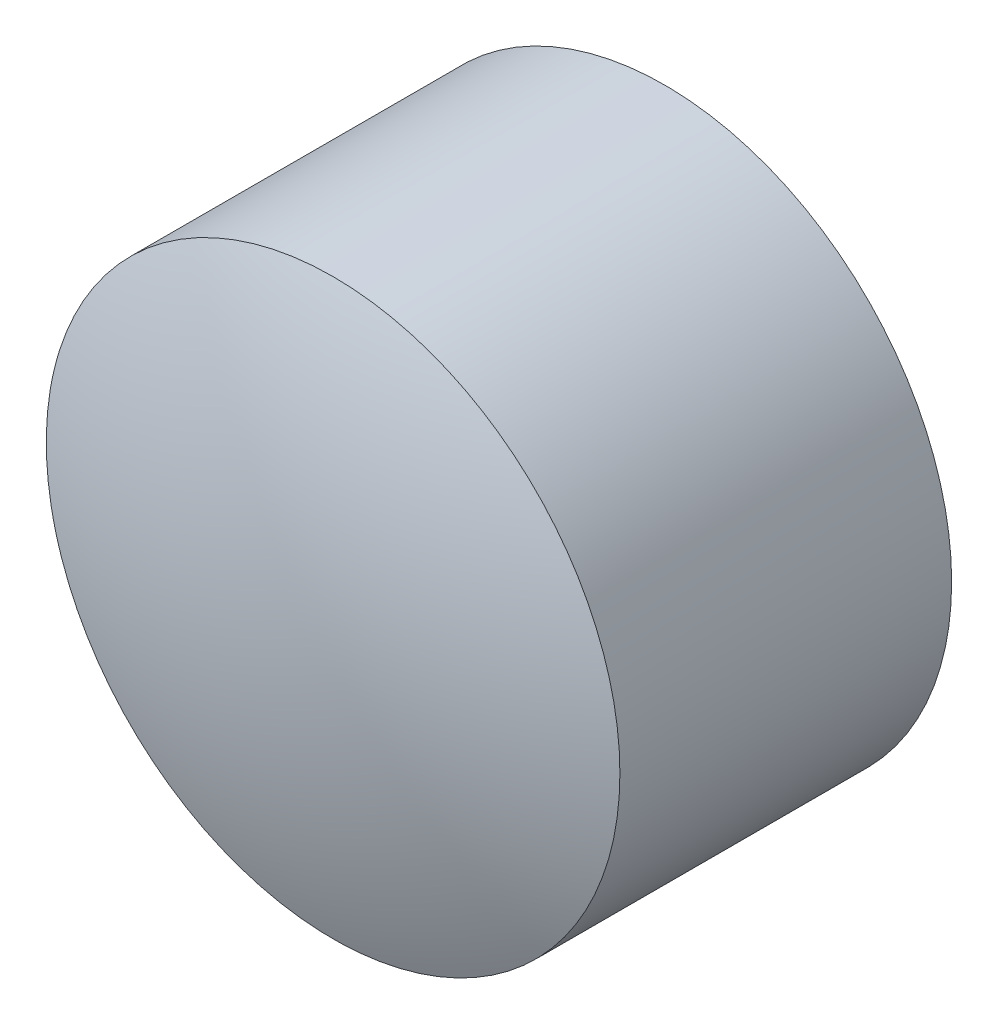
ISO-10303-21;
HEADER;
FILE_DESCRIPTION(('STEP AP214'),'2;1');
FILE_NAME('part.step','',(''),(''),'','','');
FILE_SCHEMA(('AUTOMOTIVE_DESIGN { 1 0 10303 214 1 1 1 1 }'));
ENDSEC;
DATA;
#1=APPLICATION_CONTEXT('core data for automotive mechanical design processes');
#2=APPLICATION_PROTOCOL_DEFINITION('international standard','automotive_design',2000,#1);
#3=PRODUCT_CONTEXT('',#1,'mechanical');
#4=PRODUCT('Part','Part','',(#3));
#5=PRODUCT_RELATED_PRODUCT_CATEGORY('part','',(#4));
#6=PRODUCT_DEFINITION_FORMATION('','',#4);
#7=PRODUCT_DEFINITION_CONTEXT('part definition',#1,'design');
#8=PRODUCT_DEFINITION('design','',#6,#7);
#9=PRODUCT_DEFINITION_SHAPE('','',#8);
#10=(LENGTH_UNIT() NAMED_UNIT(*) SI_UNIT(.MILLI.,.METRE.));
#11=(NAMED_UNIT(*) PLANE_ANGLE_UNIT() SI_UNIT($,.RADIAN.));
#12=(NAMED_UNIT(*) SI_UNIT($,.STERADIAN.) SOLID_ANGLE_UNIT());
#13=UNCERTAINTY_MEASURE_WITH_UNIT(LENGTH_MEASURE(1.E-05),#10,'distance_accuracy_value','');
#14=(GEOMETRIC_REPRESENTATION_CONTEXT(3) GLOBAL_UNCERTAINTY_ASSIGNED_CONTEXT((#13)) GLOBAL_UNIT_ASSIGNED_CONTEXT((#10,
#11,#12)) REPRESENTATION_CONTEXT('',''));
#15=CARTESIAN_POINT('',(0.,0.,0.));
#16=DIRECTION('',(0.,0.,1.));
#17=DIRECTION('',(1.,0.,0.));
#18=AXIS2_PLACEMENT_3D('',#15,#16,#17);
#19=CARTESIAN_POINT('',(0.,0.,-50.));
#20=DIRECTION('',(0.,1.,0.));
#21=DIRECTION('',(0.,0.,1.));
#22=AXIS2_PLACEMENT_3D('',#19,#20,#21);
#23=SPHERICAL_SURFACE('',#22,50.);
#24=CARTESIAN_POINT('',(-2.50000000000002,0.,-0.0625391114045517));
#25=CARTESIAN_POINT('',(-2.49999957859405,-0.0701921601409066,-0.0625391114045523));
#26=CARTESIAN_POINT('',(-2.49704119036997,-0.140397219746571,-0.0625391114045524));
#27=CARTESIAN_POINT('',(-2.48522688664738,-0.28032218030128,-0.0625391114045526));
#28=CARTESIAN_POINT('',(-2.47636923003984,-0.35004193187638,-0.0625391114045526));
#29=CARTESIAN_POINT('',(-2.45279621284333,-0.488604768391329,-0.0625391114045523));
#30=CARTESIAN_POINT('',(-2.43807155381807,-0.557446281838637,-0.062539111404552));
#31=CARTESIAN_POINT('',(-2.4028660568639,-0.693682438387356,-0.062539111404553));
#32=CARTESIAN_POINT('',(-2.38238054773116,-0.761075859364823,-0.0625391114045545));
#33=CARTESIAN_POINT('',(-2.31256596022029,-0.960073511095619,-0.0625391114045556));
#34=CARTESIAN_POINT('',(-2.25482147715632,-1.08883002658189,-0.0625391114045519));
#35=CARTESIAN_POINT('',(-2.11850509546783,-1.33480671324968,-0.0625391114045531));
#36=CARTESIAN_POINT('',(-2.03993240519527,-1.45202644570358,-0.062539111404558));
#37=CARTESIAN_POINT('',(-1.90824104158855,-1.61665670149236,-0.0625391114045557));
#38=CARTESIAN_POINT('',(-1.86200376346691,-1.66969790866932,-0.0625391114045533));
#39=CARTESIAN_POINT('',(-1.7652617445013,-1.77166010229668,-0.0625391114045517));
#40=CARTESIAN_POINT('',(-1.71476116111232,-1.82058501195093,-0.0625391114045525));
#41=CARTESIAN_POINT('',(-1.60979379086975,-1.91402801028407,-0.0625391114045525));
#42=CARTESIAN_POINT('',(-1.55532521772511,-1.95854409267403,-0.0625391114045517));
#43=CARTESIAN_POINT('',(-1.44283652707778,-2.04283393968631,-0.0625391114045532));
#44=CARTESIAN_POINT('',(-1.38481558991688,-2.08260660354312,-0.0625391114045555));
#45=CARTESIAN_POINT('',(-1.20605688684626,-2.19433902108584,-0.0625391114045568));
#46=CARTESIAN_POINT('',(-1.08051229902379,-2.25881176962249,-0.0625391114045502));
#47=CARTESIAN_POINT('',(-0.82044866534367,-2.36572576780543,-0.0625391114045548));
#48=CARTESIAN_POINT('',(-0.685929715353721,-2.40816725275589,-0.0625391114045659));
#49=CARTESIAN_POINT('',(-0.411658452727804,-2.4698754093343,-0.0625391114045478));
#50=CARTESIAN_POINT('',(-0.27190611214691,-2.48914195719599,-0.0625391114045186));
#51=CARTESIAN_POINT('',(0.0088493833698798,-2.50393336678852,-0.0625391114045864));
#52=CARTESIAN_POINT('',(0.149852538305775,-2.49945822851936,-0.0625391114046833));
#53=CARTESIAN_POINT('',(0.429089566414092,-2.46691127437828,-0.0625391114046602));
#54=CARTESIAN_POINT('',(0.567323454371757,-2.43883958452381,-0.0625391114045402));
#55=CARTESIAN_POINT('',(0.837181598278565,-2.35984414960636,-0.0625391114045648));
#56=CARTESIAN_POINT('',(0.968805783615774,-2.30892016046832,-0.0625391114047095));
#57=CARTESIAN_POINT('',(1.15831539836,-2.21658970518456,-0.0625391114046457));
#58=CARTESIAN_POINT('',(1.22019432778365,-2.18313388308009,-0.0625391114045775));
#59=CARTESIAN_POINT('',(1.34091721274009,-2.11113062703742,-0.0625391114045275));
#60=CARTESIAN_POINT('',(1.39976186772843,-2.07258437389819,-0.0625391114045456));
#61=CARTESIAN_POINT('',(1.51396685497285,-1.99068832001472,-0.0625391114045594));
#62=CARTESIAN_POINT('',(1.56932875281648,-1.94734070215083,-0.0625391114045549));
#63=CARTESIAN_POINT('',(1.67624909475045,-1.8561083195029,-0.0625391114045501));
#64=CARTESIAN_POINT('',(1.72780381663946,-1.80821921638076,-0.0625391114045496));
#65=CARTESIAN_POINT('',(1.87606499663813,-1.65833806721551,-0.0625391114045494));
#66=CARTESIAN_POINT('',(1.9665198094697,-1.55002343215253,-0.062539111404551));
#67=CARTESIAN_POINT('',(2.12792803992925,-1.31973216127891,-0.062539111404554));
#68=CARTESIAN_POINT('',(2.19888219872262,-1.19775604495108,-0.0625391114045555));
#69=CARTESIAN_POINT('',(2.28922036838053,-1.00719593074416,-0.062539111404554));
#70=CARTESIAN_POINT('',(2.31667396775295,-0.942328148625664,-0.062539111404553));
#71=CARTESIAN_POINT('',(2.36599985215669,-0.810545469586504,-0.062539111404552));
#72=CARTESIAN_POINT('',(2.38787665411542,-0.74363227886014,-0.0625391114045522));
#73=CARTESIAN_POINT('',(2.42587893556121,-0.608313494474027,-0.0625391114045529));
#74=CARTESIAN_POINT('',(2.44201349688161,-0.539910440658643,-0.0625391114045534));
#75=CARTESIAN_POINT('',(2.46846528786216,-0.402001502904016,-0.0625391114045516));
#76=CARTESIAN_POINT('',(2.47878423329697,-0.332495950462251,-0.0625391114045492));
#77=CARTESIAN_POINT('',(2.4907698403374,-0.219068891594866,-0.0625391114045501));
#78=CARTESIAN_POINT('',(2.49423005493284,-0.175328990157971,-0.0625391114045517));
#79=CARTESIAN_POINT('',(2.49884526644236,-0.0877277384809803,-0.0625391114045533));
#80=CARTESIAN_POINT('',(2.50000026335643,-0.0438663882408846,-0.0625391114045533));
#81=CARTESIAN_POINT('',(2.49999957859409,0.0701921601408977,-0.0625391114045531));
#82=CARTESIAN_POINT('',(2.49704119037,0.140397219746562,-0.0625391114045527));
#83=CARTESIAN_POINT('',(2.48522688664737,0.280322180301266,-0.0625391114045523));
#84=CARTESIAN_POINT('',(2.4763692300398,0.35004193187636,-0.0625391114045524));
#85=CARTESIAN_POINT('',(2.45279621284329,0.48860476839132,-0.0625391114045526));
#86=CARTESIAN_POINT('',(2.43807155381808,0.557446281838645,-0.0625391114045529));
#87=CARTESIAN_POINT('',(2.40286605686389,0.693682438387372,-0.0625391114045521));
#88=CARTESIAN_POINT('',(2.38238054773108,0.761075859364831,-0.0625391114045511));
#89=CARTESIAN_POINT('',(2.31256596022003,0.960073511095562,-0.0625391114045494));
#90=CARTESIAN_POINT('',(2.25482147715595,1.08883002658176,-0.0625391114045499));
#91=CARTESIAN_POINT('',(2.11850509546753,1.33480671324957,-0.0625391114045551));
#92=CARTESIAN_POINT('',(2.03993240519515,1.45202644570356,-0.0625391114045597));
#93=CARTESIAN_POINT('',(1.90824104158856,1.61665670149242,-0.0625391114045563));
#94=CARTESIAN_POINT('',(1.86200376346694,1.6696979086694,-0.0625391114045535));
#95=CARTESIAN_POINT('',(1.76526174450128,1.77166010229671,-0.0625391114045516));
#96=CARTESIAN_POINT('',(1.71476116111223,1.82058501195089,-0.0625391114045525));
#97=CARTESIAN_POINT('',(1.60979379086963,1.91402801028399,-0.0625391114045525));
#98=CARTESIAN_POINT('',(1.55532521772502,1.95854409267399,-0.0625391114045516));
#99=CARTESIAN_POINT('',(1.44283652707774,2.04283393968632,-0.0625391114045534));
#100=CARTESIAN_POINT('',(1.38481558991686,2.08260660354316,-0.062539111404556));
#101=CARTESIAN_POINT('',(1.20605688684625,2.19433902108591,-0.0625391114045577));
#102=CARTESIAN_POINT('',(1.08051229902374,2.25881176962251,-0.0625391114045504));
#103=CARTESIAN_POINT('',(0.820448665343577,2.36572576780538,-0.0625391114045546));
#104=CARTESIAN_POINT('',(0.685929715353623,2.40816725275584,-0.062539111404566));
#105=CARTESIAN_POINT('',(0.411658452727708,2.46987540933427,-0.0625391114045482));
#106=CARTESIAN_POINT('',(0.27190611214682,2.48914195719597,-0.062539111404519));
#107=CARTESIAN_POINT('',(-0.00884938336994466,2.50393336678848,-0.062539111404586));
#108=CARTESIAN_POINT('',(-0.149852538305822,2.49945822851929,-0.0625391114046824));
#109=CARTESIAN_POINT('',(-0.429089566414143,2.46691127437825,-0.0625391114046609));
#110=CARTESIAN_POINT('',(-0.567323454371828,2.43883958452386,-0.062539111404543));
#111=CARTESIAN_POINT('',(-0.837181598278664,2.35984414960642,-0.062539111404562));
#112=CARTESIAN_POINT('',(-0.968805783615878,2.30892016046831,-0.0625391114046989));
#113=CARTESIAN_POINT('',(-1.15831539836002,2.21658970518436,-0.0625391114046398));
#114=CARTESIAN_POINT('',(-1.22019432778362,2.18313388307981,-0.062539111404576));
#115=CARTESIAN_POINT('',(-1.34091721274009,2.11113062703719,-0.0625391114045291));
#116=CARTESIAN_POINT('',(-1.39976186772851,2.07258437389808,-0.062539111404546));
#117=CARTESIAN_POINT('',(-1.51396685497293,1.99068832001466,-0.062539111404559));
#118=CARTESIAN_POINT('',(-1.5693287528165,1.94734070215069,-0.062539111404555));
#119=CARTESIAN_POINT('',(-1.67624909475046,1.85610831950276,-0.06253911140455));
#120=CARTESIAN_POINT('',(-1.72780381663953,1.80821921638069,-0.0625391114045489));
#121=CARTESIAN_POINT('',(-1.87606499663823,1.65833806721552,-0.0625391114045482));
#122=CARTESIAN_POINT('',(-1.96651980946964,1.5500234321524,-0.062539111404551));
#123=CARTESIAN_POINT('',(-2.12792803992917,1.31973216127872,-0.062539111404554));
#124=CARTESIAN_POINT('',(-2.19888219872268,1.19775604495099,-0.0625391114045541));
#125=CARTESIAN_POINT('',(-2.28922036838048,1.00719593074403,-0.062539111404553));
#126=CARTESIAN_POINT('',(-2.31667396775282,0.942328148625502,-0.0625391114045525));
#127=CARTESIAN_POINT('',(-2.36599985215658,0.810545469586343,-0.0625391114045525));
#128=CARTESIAN_POINT('',(-2.38787665411542,0.743632278860013,-0.0625391114045531));
#129=CARTESIAN_POINT('',(-2.42587893556125,0.608313494473926,-0.0625391114045519));
#130=CARTESIAN_POINT('',(-2.44201349688157,0.539910440658533,-0.0625391114045502));
#131=CARTESIAN_POINT('',(-2.46846528786216,0.402001502903924,-0.0625391114045548));
#132=CARTESIAN_POINT('',(-2.47878423329708,0.332495950462186,-0.0625391114045613));
#133=CARTESIAN_POINT('',(-2.49076984033754,0.219068891594827,-0.0625391114045586));
#134=CARTESIAN_POINT('',(-2.49423005493297,0.175328990157938,-0.0625391114045543));
#135=CARTESIAN_POINT('',(-2.49884526644243,0.0877277384809596,-0.0625391114045507));
#136=CARTESIAN_POINT('',(-2.50000026335646,0.0438663882408702,-0.0625391114045513));
#137=CARTESIAN_POINT('',(-2.50000000000002,0.,-0.0625391114045517));
#138=B_SPLINE_CURVE_WITH_KNOTS('',3,(#24,#25,#26,#27,#28,#29,#30,#31,#32,#33,#34,#35,#36,#37,
#38,#39,#40,#41,#42,#43,#44,#45,#46,#47,#48,#49,#50,#51,#52,#53,#54,#55,#56,#57,#58,#59,#60,#61,
#62,#63,#64,#65,#66,#67,#68,#69,#70,#71,#72,#73,#74,#75,#76,#77,#78,#79,#80,#81,#82,#83,#84,#85,
#86,#87,#88,#89,#90,#91,#92,#93,#94,#95,#96,#97,#98,#99,#100,#101,#102,#103,#104,#105,#106,#107,
#108,#109,#110,#111,#112,#113,#114,#115,#116,#117,#118,#119,#120,#121,#122,#123,#124,#125,#126,
#127,#128,#129,#130,#131,#132,#133,#134,#135,#136,#137),.UNSPECIFIED.,.T.,.F.,(4,2,2,2,2,2,2,2,
2,2,2,2,2,2,2,2,2,2,2,2,2,2,2,2,2,2,2,2,2,2,2,2,2,2,2,2,2,2,2,2,2,2,2,2,2,2,2,2,2,2,2,2,2,2,2,2,
4),(0.,0.210536097548766,0.421134360236821,0.63206772993543,0.843172631256739,1.26437612262391,
1.68559562558244,1.89648135421563,2.10716375740726,2.31794159779614,2.52876825685222,
2.94998200203607,3.37119124836777,3.79240274416665,4.21361423996545,4.63482348629731,
5.0560372314814,5.26686389053755,5.47764173092671,5.6883241341187,5.89920986275208,
6.32042936571049,6.74163285707771,6.952737758399,7.16367112809759,7.37426939078567,
7.58480548833447,7.7163794158964,7.84795334345832,8.05848944100708,8.26908770369513,
8.48002107339376,8.6911259747151,9.11232946608225,9.53354896904072,9.7444346976739,
9.95511710086554,10.1658949412544,10.3767216003105,10.7979353454944,11.2191445918261,
11.640356087625,12.0615675834237,12.4827768297556,12.9039905749397,13.1148172339959,
13.325595074385,13.536277477577,13.7471632062103,14.1683827091688,14.589586200536,
14.8006911018573,15.0116244715558,15.2222227342439,15.4327588317927,15.5643327593546,
15.6959066869165),.UNSPECIFIED.);
#139=CARTESIAN_POINT('',(-2.50000000000002,0.,-0.0625391114045517));
#140=VERTEX_POINT('',#139);
#141=EDGE_CURVE('E20',#140,#140,#138,.T.);
#142=ORIENTED_EDGE('',*,*,#141,.F.);
#143=EDGE_LOOP('',(#142));
#144=FACE_BOUND('',#143,.T.);
#145=ADVANCED_FACE('F15',(#144),#23,.F.);
#146=CARTESIAN_POINT('',(0.,0.,-0.0625391114045525));
#147=DIRECTION('',(0.,0.,-1.));
#148=DIRECTION('',(-1.,0.,0.));
#149=AXIS2_PLACEMENT_3D('',#146,#147,#148);
#150=PLANE('',#149);
#151=ORIENTED_EDGE('',*,*,#141,.T.);
#152=EDGE_LOOP('',(#151));
#153=FACE_BOUND('',#152,.T.);
#154=CARTESIAN_POINT('',(0.,0.,-0.0625391114045525));
#155=DIRECTION('',(0.,0.,1.));
#156=DIRECTION('',(1.,0.,0.));
#157=AXIS2_PLACEMENT_3D('',#154,#155,#156);
#158=CIRCLE('',#157,3.);
#159=CARTESIAN_POINT('',(3.,0.,-0.0625391114045525));
#160=VERTEX_POINT('',#159);
#161=EDGE_CURVE('E26',#160,#160,#158,.T.);
#162=ORIENTED_EDGE('',*,*,#161,.F.);
#163=EDGE_LOOP('',(#162));
#164=FACE_BOUND('',#163,.T.);
#165=ADVANCED_FACE('F33',(#153,#164),#150,.T.);
#166=CARTESIAN_POINT('',(0.,0.,4.));
#167=CARTESIAN_POINT('',(0.,0.,4.));
#168=CARTESIAN_POINT('',(0.,0.,4.));
#169=CARTESIAN_POINT('',(0.,0.,4.));
#170=CARTESIAN_POINT('',(0.,0.,4.));
#171=CARTESIAN_POINT('',(0.,0.,4.));
#172=CARTESIAN_POINT('',(0.,0.,4.));
#173=CARTESIAN_POINT('',(0.,0.,4.));
#174=CARTESIAN_POINT('',(0.,0.,4.));
#175=CARTESIAN_POINT('',(0.,0.460757397725933,4.));
#176=CARTESIAN_POINT('',(-0.460757397725933,0.460757397725933,4.));
#177=CARTESIAN_POINT('',(-0.460757397725933,0.,4.));
#178=CARTESIAN_POINT('',(-0.460757397725933,-0.460757397725933,4.));
#179=CARTESIAN_POINT('',(0.,-0.460757397725933,4.));
#180=CARTESIAN_POINT('',(0.460757397725933,-0.460757397725933,4.));
#181=CARTESIAN_POINT('',(0.460757397725933,0.,4.));
#182=CARTESIAN_POINT('',(0.460757397725933,0.460757397725933,4.));
#183=CARTESIAN_POINT('',(0.,0.460757397725933,4.));
#184=CARTESIAN_POINT('',(0.,1.17800036260746,3.93548709282455));
#185=CARTESIAN_POINT('',(-1.17800036260746,1.17800036260746,3.93548709282455));
#186=CARTESIAN_POINT('',(-1.17800036260746,0.,3.93548709282455));
#187=CARTESIAN_POINT('',(-1.17800036260746,-1.17800036260746,3.93548709282455));
#188=CARTESIAN_POINT('',(0.,-1.17800036260746,3.93548709282455));
#189=CARTESIAN_POINT('',(1.17800036260746,-1.17800036260746,3.93548709282455));
#190=CARTESIAN_POINT('',(1.17800036260746,0.,3.93548709282455));
#191=CARTESIAN_POINT('',(1.17800036260746,1.17800036260746,3.93548709282455));
#192=CARTESIAN_POINT('',(0.,1.17800036260746,3.93548709282455));
#193=CARTESIAN_POINT('',(0.,2.17876653622799,3.70567004518686));
#194=CARTESIAN_POINT('',(-2.17876653622799,2.17876653622799,3.70567004518686));
#195=CARTESIAN_POINT('',(-2.17876653622799,0.,3.70567004518686));
#196=CARTESIAN_POINT('',(-2.17876653622799,-2.17876653622799,3.70567004518686));
#197=CARTESIAN_POINT('',(0.,-2.17876653622799,3.70567004518686));
#198=CARTESIAN_POINT('',(2.17876653622799,-2.17876653622799,3.70567004518686));
#199=CARTESIAN_POINT('',(2.17876653622799,0.,3.70567004518686));
#200=CARTESIAN_POINT('',(2.17876653622799,2.17876653622799,3.70567004518686));
#201=CARTESIAN_POINT('',(0.,2.17876653622799,3.70567004518686));
#202=CARTESIAN_POINT('',(0.,2.71408146605629,3.52260971609754));
#203=CARTESIAN_POINT('',(-2.71408146605629,2.71408146605629,3.52260971609754));
#204=CARTESIAN_POINT('',(-2.71408146605629,0.,3.52260971609754));
#205=CARTESIAN_POINT('',(-2.71408146605629,-2.71408146605629,3.52260971609754));
#206=CARTESIAN_POINT('',(0.,-2.71408146605629,3.52260971609754));
#207=CARTESIAN_POINT('',(2.71408146605629,-2.71408146605629,3.52260971609754));
#208=CARTESIAN_POINT('',(2.71408146605629,0.,3.52260971609754));
#209=CARTESIAN_POINT('',(2.71408146605629,2.71408146605629,3.52260971609754));
#210=CARTESIAN_POINT('',(0.,2.71408146605629,3.52260971609754));
#211=CARTESIAN_POINT('',(0.,3.,3.40729838552752));
#212=CARTESIAN_POINT('',(-3.,3.,3.40729838552752));
#213=CARTESIAN_POINT('',(-3.,0.,3.40729838552752));
#214=CARTESIAN_POINT('',(-3.,-3.,3.40729838552752));
#215=CARTESIAN_POINT('',(0.,-3.,3.40729838552752));
#216=CARTESIAN_POINT('',(3.,-3.,3.40729838552752));
#217=CARTESIAN_POINT('',(3.,0.,3.40729838552752));
#218=CARTESIAN_POINT('',(3.,3.,3.40729838552752));
#219=CARTESIAN_POINT('',(0.,3.,3.40729838552752));
#220=(BOUNDED_SURFACE() B_SPLINE_SURFACE(3,2,((#166,#167,#168,#169,#170,#171,#172,#173,#174),
(#175,#176,#177,#178,#179,#180,#181,#182,#183),(#184,#185,#186,#187,#188,#189,#190,#191,#192),
(#193,#194,#195,#196,#197,#198,#199,#200,#201),(#202,#203,#204,#205,#206,#207,#208,#209,#210),
(#211,#212,#213,#214,#215,#216,#217,#218,#219)),.UNSPECIFIED.,.F.,.T.,
.F.) B_SPLINE_SURFACE_WITH_KNOTS((4,1,1,4),(3,2,2,2,3),(0.,0.449242471985797,0.699409211733755,
1.),(0.,90.,180.,270.,360.),
.UNSPECIFIED.) GEOMETRIC_REPRESENTATION_ITEM() RATIONAL_B_SPLINE_SURFACE(((1.,0.707106781186548,
1.,0.707106781186548,1.,0.707106781186548,1.,0.707106781186548,1.),(1.,0.707106781186548,1.,
0.707106781186548,1.,0.707106781186548,1.,0.707106781186548,1.),(1.,0.707106781186548,1.,
0.707106781186548,1.,0.707106781186548,1.,0.707106781186548,1.),(1.,0.707106781186548,1.,
0.707106781186548,1.,0.707106781186548,1.,0.707106781186548,1.),(1.,0.707106781186548,1.,
0.707106781186548,1.,0.707106781186548,1.,0.707106781186548,1.),(1.,0.707106781186548,1.,
0.707106781186548,1.,0.707106781186548,1.,0.707106781186548,1.))) REPRESENTATION_ITEM('') SURFACE());
#221=CARTESIAN_POINT('',(0.,0.,3.40729838552752));
#222=DIRECTION('',(0.,0.,1.));
#223=DIRECTION('',(1.,0.,0.));
#224=AXIS2_PLACEMENT_3D('',#221,#222,#223);
#225=CIRCLE('',#224,3.);
#226=CARTESIAN_POINT('',(3.,0.,3.40729838552752));
#227=VERTEX_POINT('',#226);
#228=EDGE_CURVE('E10',#227,#227,#225,.F.);
#229=ORIENTED_EDGE('',*,*,#228,.F.);
#230=EDGE_LOOP('',(#229));
#231=FACE_BOUND('',#230,.T.);
#232=CARTESIAN_POINT('',(0.,0.,4.));
#233=VERTEX_POINT('',#232);
#234=VERTEX_LOOP('',#233);
#235=FACE_BOUND('',#234,.T.);
#236=ADVANCED_FACE('F30',(#231,#235),#220,.T.);
#237=CARTESIAN_POINT('',(0.,0.,-0.0625391114045525));
#238=DIRECTION('',(0.,0.,1.));
#239=DIRECTION('',(1.,0.,0.));
#240=AXIS2_PLACEMENT_3D('',#237,#238,#239);
#241=CYLINDRICAL_SURFACE('',#240,3.);
#242=ORIENTED_EDGE('',*,*,#161,.T.);
#243=EDGE_LOOP('',(#242));
#244=FACE_BOUND('',#243,.T.);
#245=ORIENTED_EDGE('',*,*,#228,.T.);
#246=EDGE_LOOP('',(#245));
#247=FACE_BOUND('',#246,.T.);
#248=ADVANCED_FACE('F32',(#244,#247),#241,.T.);
#249=CLOSED_SHELL('',(#145,#165,#236,#248));
#250=MANIFOLD_SOLID_BREP('B1',#249);
#251=ADVANCED_BREP_SHAPE_REPRESENTATION('',(#18,#250),#14);
#252=SHAPE_DEFINITION_REPRESENTATION(#9,#251);
ENDSEC;
END-ISO-10303-21;
